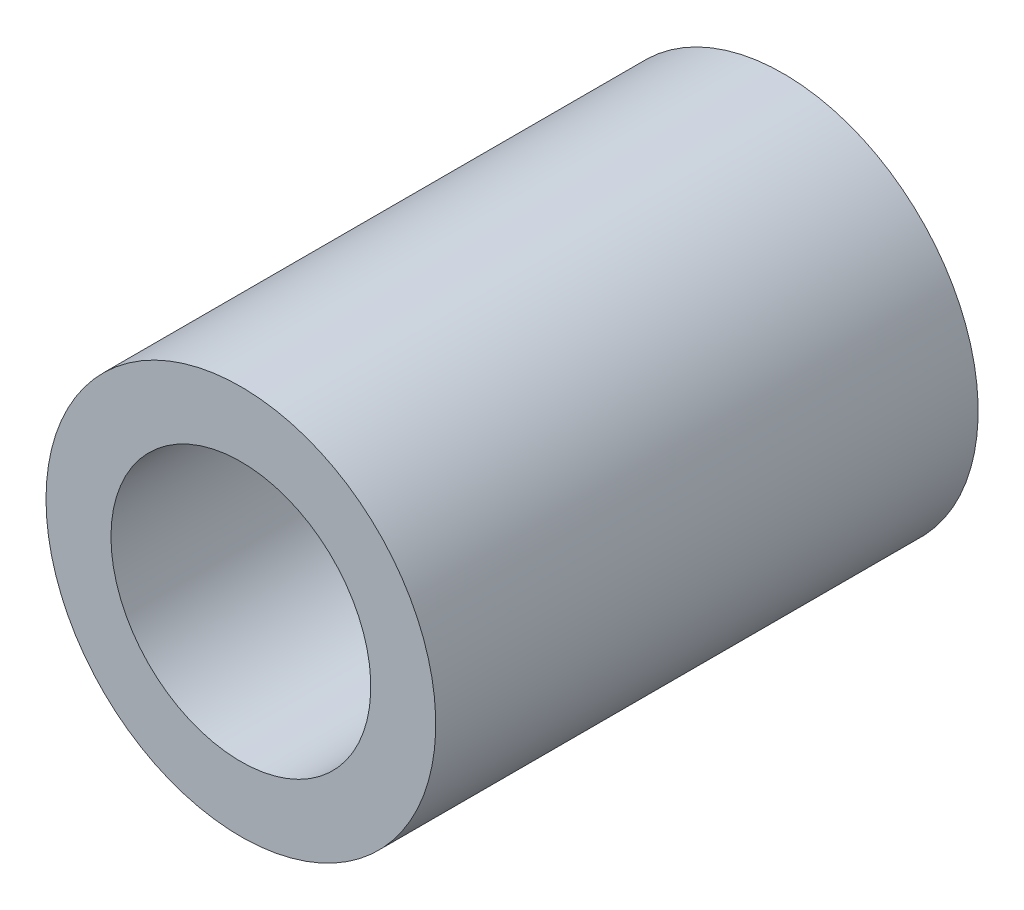
ISO-10303-21;
HEADER;
FILE_DESCRIPTION(('STEP AP214'),'2;1');
FILE_NAME('part.step','',(''),(''),'','','');
FILE_SCHEMA(('AUTOMOTIVE_DESIGN { 1 0 10303 214 1 1 1 1 }'));
ENDSEC;
DATA;
#1=APPLICATION_CONTEXT('core data for automotive mechanical design processes');
#2=APPLICATION_PROTOCOL_DEFINITION('international standard','automotive_design',2000,#1);
#3=PRODUCT_CONTEXT('',#1,'mechanical');
#4=PRODUCT('Part','Part','',(#3));
#5=PRODUCT_RELATED_PRODUCT_CATEGORY('part','',(#4));
#6=PRODUCT_DEFINITION_FORMATION('','',#4);
#7=PRODUCT_DEFINITION_CONTEXT('part definition',#1,'design');
#8=PRODUCT_DEFINITION('design','',#6,#7);
#9=PRODUCT_DEFINITION_SHAPE('','',#8);
#10=(LENGTH_UNIT() NAMED_UNIT(*) SI_UNIT(.MILLI.,.METRE.));
#11=(NAMED_UNIT(*) PLANE_ANGLE_UNIT() SI_UNIT($,.RADIAN.));
#12=(NAMED_UNIT(*) SI_UNIT($,.STERADIAN.) SOLID_ANGLE_UNIT());
#13=UNCERTAINTY_MEASURE_WITH_UNIT(LENGTH_MEASURE(1.E-05),#10,'distance_accuracy_value','');
#14=(GEOMETRIC_REPRESENTATION_CONTEXT(3) GLOBAL_UNCERTAINTY_ASSIGNED_CONTEXT((#13)) GLOBAL_UNIT_ASSIGNED_CONTEXT((#10,
#11,#12)) REPRESENTATION_CONTEXT('',''));
#15=CARTESIAN_POINT('',(0.,0.,0.));
#16=DIRECTION('',(0.,0.,1.));
#17=DIRECTION('',(1.,0.,0.));
#18=AXIS2_PLACEMENT_3D('',#15,#16,#17);
#19=CARTESIAN_POINT('',(31.63,0.,-0.01));
#20=DIRECTION('',(0.,0.,-1.));
#21=DIRECTION('',(-1.,0.,0.));
#22=AXIS2_PLACEMENT_3D('',#19,#20,#21);
#23=CYLINDRICAL_SURFACE('',#22,0.4);
#24=CARTESIAN_POINT('',(31.63,0.,1.66));
#25=DIRECTION('',(0.,0.,-1.));
#26=DIRECTION('',(-1.,0.,0.));
#27=AXIS2_PLACEMENT_3D('',#24,#25,#26);
#28=CIRCLE('',#27,0.4);
#29=CARTESIAN_POINT('',(31.23,0.,1.66));
#30=VERTEX_POINT('',#29);
#31=EDGE_CURVE('E27',#30,#30,#28,.T.);
#32=ORIENTED_EDGE('',*,*,#31,.F.);
#33=EDGE_LOOP('',(#32));
#34=FACE_BOUND('',#33,.T.);
#35=CARTESIAN_POINT('',(31.63,0.,-0.01));
#36=DIRECTION('',(0.,0.,-1.));
#37=DIRECTION('',(-1.,0.,0.));
#38=AXIS2_PLACEMENT_3D('',#35,#36,#37);
#39=CIRCLE('',#38,0.4);
#40=CARTESIAN_POINT('',(31.23,0.,-0.01));
#41=VERTEX_POINT('',#40);
#42=EDGE_CURVE('E18',#41,#41,#39,.T.);
#43=ORIENTED_EDGE('',*,*,#42,.T.);
#44=EDGE_LOOP('',(#43));
#45=FACE_BOUND('',#44,.T.);
#46=ADVANCED_FACE('F15',(#34,#45),#23,.F.);
#47=CARTESIAN_POINT('',(31.63,0.,-0.01));
#48=DIRECTION('',(0.,0.,1.));
#49=DIRECTION('',(1.,0.,0.));
#50=AXIS2_PLACEMENT_3D('',#47,#48,#49);
#51=PLANE('',#50);
#52=ORIENTED_EDGE('',*,*,#42,.F.);
#53=EDGE_LOOP('',(#52));
#54=FACE_BOUND('',#53,.T.);
#55=CARTESIAN_POINT('',(31.63,0.,-0.01));
#56=DIRECTION('',(0.,0.,-1.));
#57=DIRECTION('',(-1.,0.,0.));
#58=AXIS2_PLACEMENT_3D('',#55,#56,#57);
#59=CIRCLE('',#58,0.6);
#60=CARTESIAN_POINT('',(31.03,0.,-0.01));
#61=VERTEX_POINT('',#60);
#62=EDGE_CURVE('E22',#61,#61,#59,.F.);
#63=ORIENTED_EDGE('',*,*,#62,.F.);
#64=EDGE_LOOP('',(#63));
#65=FACE_BOUND('',#64,.T.);
#66=ADVANCED_FACE('F36',(#54,#65),#51,.F.);
#67=CARTESIAN_POINT('',(31.63,0.,1.66));
#68=DIRECTION('',(0.,0.,1.));
#69=DIRECTION('',(1.,0.,0.));
#70=AXIS2_PLACEMENT_3D('',#67,#68,#69);
#71=PLANE('',#70);
#72=ORIENTED_EDGE('',*,*,#31,.T.);
#73=EDGE_LOOP('',(#72));
#74=FACE_BOUND('',#73,.T.);
#75=CARTESIAN_POINT('',(31.63,0.,1.66));
#76=DIRECTION('',(0.,0.,-1.));
#77=DIRECTION('',(-1.,0.,0.));
#78=AXIS2_PLACEMENT_3D('',#75,#76,#77);
#79=CIRCLE('',#78,0.6);
#80=CARTESIAN_POINT('',(31.03,0.,1.66));
#81=VERTEX_POINT('',#80);
#82=EDGE_CURVE('E10',#81,#81,#79,.T.);
#83=ORIENTED_EDGE('',*,*,#82,.F.);
#84=EDGE_LOOP('',(#83));
#85=FACE_BOUND('',#84,.T.);
#86=ADVANCED_FACE('F39',(#74,#85),#71,.T.);
#87=CARTESIAN_POINT('',(31.63,0.,-0.01));
#88=DIRECTION('',(0.,0.,-1.));
#89=DIRECTION('',(-1.,0.,0.));
#90=AXIS2_PLACEMENT_3D('',#87,#88,#89);
#91=CYLINDRICAL_SURFACE('',#90,0.6);
#92=ORIENTED_EDGE('',*,*,#82,.T.);
#93=EDGE_LOOP('',(#92));
#94=FACE_BOUND('',#93,.T.);
#95=ORIENTED_EDGE('',*,*,#62,.T.);
#96=EDGE_LOOP('',(#95));
#97=FACE_BOUND('',#96,.T.);
#98=ADVANCED_FACE('F42',(#94,#97),#91,.T.);
#99=CLOSED_SHELL('',(#46,#66,#86,#98));
#100=MANIFOLD_SOLID_BREP('B1',#99);
#101=ADVANCED_BREP_SHAPE_REPRESENTATION('',(#18,#100),#14);
#102=SHAPE_DEFINITION_REPRESENTATION(#9,#101);
ENDSEC;
END-ISO-10303-21;
